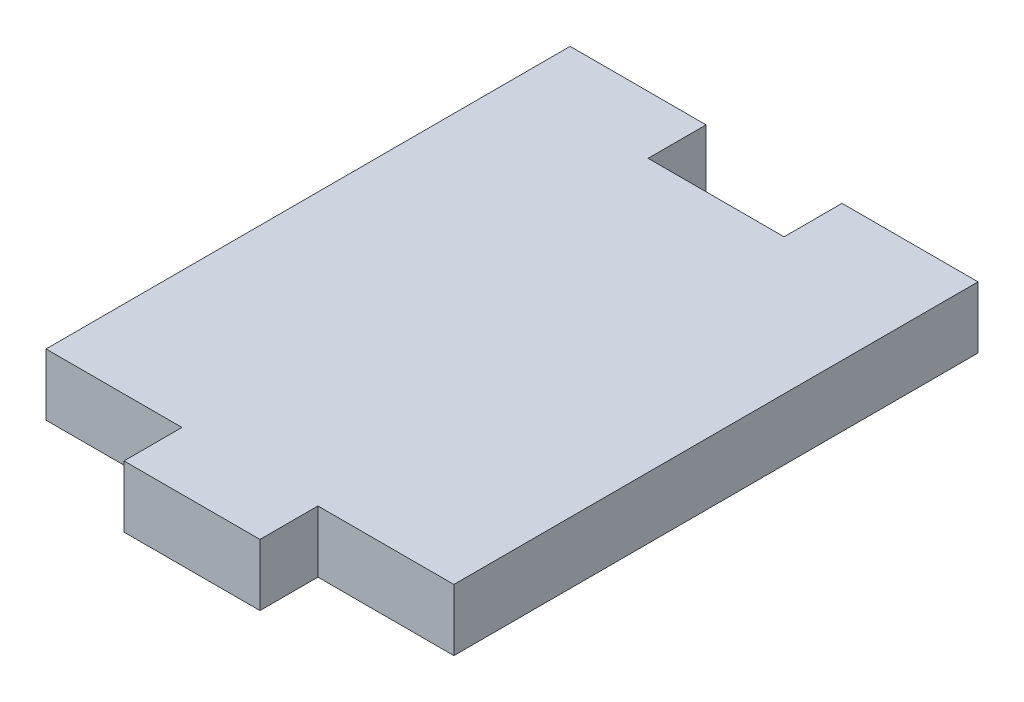
ISO-10303-21;
HEADER;
FILE_DESCRIPTION(('STEP AP214'),'2;1');
FILE_NAME('part.step','',(''),(''),'','','');
FILE_SCHEMA(('AUTOMOTIVE_DESIGN { 1 0 10303 214 1 1 1 1 }'));
ENDSEC;
DATA;
#1=APPLICATION_CONTEXT('core data for automotive mechanical design processes');
#2=APPLICATION_PROTOCOL_DEFINITION('international standard','automotive_design',2000,#1);
#3=PRODUCT_CONTEXT('',#1,'mechanical');
#4=PRODUCT('Part','Part','',(#3));
#5=PRODUCT_RELATED_PRODUCT_CATEGORY('part','',(#4));
#6=PRODUCT_DEFINITION_FORMATION('','',#4);
#7=PRODUCT_DEFINITION_CONTEXT('part definition',#1,'design');
#8=PRODUCT_DEFINITION('design','',#6,#7);
#9=PRODUCT_DEFINITION_SHAPE('','',#8);
#10=(LENGTH_UNIT() NAMED_UNIT(*) SI_UNIT(.MILLI.,.METRE.));
#11=(NAMED_UNIT(*) PLANE_ANGLE_UNIT() SI_UNIT($,.RADIAN.));
#12=(NAMED_UNIT(*) SI_UNIT($,.STERADIAN.) SOLID_ANGLE_UNIT());
#13=UNCERTAINTY_MEASURE_WITH_UNIT(LENGTH_MEASURE(1.E-05),#10,'distance_accuracy_value','');
#14=(GEOMETRIC_REPRESENTATION_CONTEXT(3) GLOBAL_UNCERTAINTY_ASSIGNED_CONTEXT((#13)) GLOBAL_UNIT_ASSIGNED_CONTEXT((#10,
#11,#12)) REPRESENTATION_CONTEXT('',''));
#15=CARTESIAN_POINT('',(0.,0.,0.));
#16=DIRECTION('',(0.,0.,1.));
#17=DIRECTION('',(1.,0.,0.));
#18=AXIS2_PLACEMENT_3D('',#15,#16,#17);
#19=CARTESIAN_POINT('',(0.,6.35,0.));
#20=DIRECTION('',(0.,0.,-1.));
#21=DIRECTION('',(-1.,0.,0.));
#22=AXIS2_PLACEMENT_3D('',#19,#20,#21);
#23=PLANE('',#22);
#24=DIRECTION('',(1.,0.,0.));
#25=VECTOR('',#24,1.);
#26=CARTESIAN_POINT('',(0.,0.,0.));
#27=LINE('',#26,#25);
#28=CARTESIAN_POINT('',(0.,0.,0.));
#29=VERTEX_POINT('',#28);
#30=CARTESIAN_POINT('',(14.,0.,0.));
#31=VERTEX_POINT('',#30);
#32=EDGE_CURVE('E156',#29,#31,#27,.T.);
#33=ORIENTED_EDGE('',*,*,#32,.T.);
#34=DIRECTION('',(0.,-1.,0.));
#35=VECTOR('',#34,1.);
#36=CARTESIAN_POINT('',(14.,6.35,0.));
#37=LINE('',#36,#35);
#38=CARTESIAN_POINT('',(14.,6.35,0.));
#39=VERTEX_POINT('',#38);
#40=EDGE_CURVE('E40',#39,#31,#37,.T.);
#41=ORIENTED_EDGE('',*,*,#40,.F.);
#42=DIRECTION('',(1.,0.,0.));
#43=VECTOR('',#42,1.);
#44=CARTESIAN_POINT('',(0.,6.35,0.));
#45=LINE('',#44,#43);
#46=CARTESIAN_POINT('',(0.,6.35,0.));
#47=VERTEX_POINT('',#46);
#48=EDGE_CURVE('E104',#47,#39,#45,.T.);
#49=ORIENTED_EDGE('',*,*,#48,.F.);
#50=DIRECTION('',(0.,-1.,0.));
#51=VECTOR('',#50,1.);
#52=CARTESIAN_POINT('',(0.,6.35,0.));
#53=LINE('',#52,#51);
#54=EDGE_CURVE('E11',#47,#29,#53,.T.);
#55=ORIENTED_EDGE('',*,*,#54,.T.);
#56=EDGE_LOOP('',(#33,#41,#49,#55));
#57=FACE_BOUND('',#56,.T.);
#58=ADVANCED_FACE('F32',(#57),#23,.F.);
#59=CARTESIAN_POINT('',(14.,6.35,0.));
#60=DIRECTION('',(1.,0.,0.));
#61=DIRECTION('',(0.,0.,-1.));
#62=AXIS2_PLACEMENT_3D('',#59,#60,#61);
#63=PLANE('',#62);
#64=DIRECTION('',(0.,0.,1.));
#65=VECTOR('',#64,1.);
#66=CARTESIAN_POINT('',(14.,0.,0.));
#67=LINE('',#66,#65);
#68=CARTESIAN_POINT('',(14.,0.,5.969));
#69=VERTEX_POINT('',#68);
#70=EDGE_CURVE('E158',#31,#69,#67,.T.);
#71=ORIENTED_EDGE('',*,*,#70,.T.);
#72=DIRECTION('',(0.,-1.,0.));
#73=VECTOR('',#72,1.);
#74=CARTESIAN_POINT('',(14.,6.35,5.969));
#75=LINE('',#74,#73);
#76=CARTESIAN_POINT('',(14.,6.35,5.969));
#77=VERTEX_POINT('',#76);
#78=EDGE_CURVE('E196',#77,#69,#75,.T.);
#79=ORIENTED_EDGE('',*,*,#78,.F.);
#80=DIRECTION('',(0.,0.,1.));
#81=VECTOR('',#80,1.);
#82=CARTESIAN_POINT('',(14.,6.35,0.));
#83=LINE('',#82,#81);
#84=EDGE_CURVE('E204',#39,#77,#83,.T.);
#85=ORIENTED_EDGE('',*,*,#84,.F.);
#86=ORIENTED_EDGE('',*,*,#40,.T.);
#87=EDGE_LOOP('',(#71,#79,#85,#86));
#88=FACE_BOUND('',#87,.T.);
#89=ADVANCED_FACE('F202',(#88),#63,.F.);
#90=CARTESIAN_POINT('',(14.,6.35,5.969));
#91=DIRECTION('',(0.,0.,-1.));
#92=DIRECTION('',(-1.,0.,0.));
#93=AXIS2_PLACEMENT_3D('',#90,#91,#92);
#94=PLANE('',#93);
#95=DIRECTION('',(1.,0.,0.));
#96=VECTOR('',#95,1.);
#97=CARTESIAN_POINT('',(14.,0.,5.969));
#98=LINE('',#97,#96);
#99=CARTESIAN_POINT('',(28.,0.,5.969));
#100=VERTEX_POINT('',#99);
#101=EDGE_CURVE('E160',#69,#100,#98,.T.);
#102=ORIENTED_EDGE('',*,*,#101,.T.);
#103=DIRECTION('',(0.,-1.,0.));
#104=VECTOR('',#103,1.);
#105=CARTESIAN_POINT('',(28.,6.35,5.969));
#106=LINE('',#105,#104);
#107=CARTESIAN_POINT('',(28.,6.35,5.969));
#108=VERTEX_POINT('',#107);
#109=EDGE_CURVE('E193',#108,#100,#106,.T.);
#110=ORIENTED_EDGE('',*,*,#109,.F.);
#111=DIRECTION('',(1.,0.,0.));
#112=VECTOR('',#111,1.);
#113=CARTESIAN_POINT('',(14.,6.35,5.969));
#114=LINE('',#113,#112);
#115=EDGE_CURVE('E223',#77,#108,#114,.T.);
#116=ORIENTED_EDGE('',*,*,#115,.F.);
#117=ORIENTED_EDGE('',*,*,#78,.T.);
#118=EDGE_LOOP('',(#102,#110,#116,#117));
#119=FACE_BOUND('',#118,.T.);
#120=ADVANCED_FACE('F214',(#119),#94,.F.);
#121=CARTESIAN_POINT('',(28.,6.35,0.));
#122=DIRECTION('',(-1.,0.,0.));
#123=DIRECTION('',(0.,0.,1.));
#124=AXIS2_PLACEMENT_3D('',#121,#122,#123);
#125=PLANE('',#124);
#126=DIRECTION('',(0.,0.,-1.));
#127=VECTOR('',#126,1.);
#128=CARTESIAN_POINT('',(28.,0.,0.));
#129=LINE('',#128,#127);
#130=CARTESIAN_POINT('',(28.,0.,0.));
#131=VERTEX_POINT('',#130);
#132=EDGE_CURVE('E162',#100,#131,#129,.T.);
#133=ORIENTED_EDGE('',*,*,#132,.T.);
#134=DIRECTION('',(0.,-1.,0.));
#135=VECTOR('',#134,1.);
#136=CARTESIAN_POINT('',(28.,6.35,0.));
#137=LINE('',#136,#135);
#138=CARTESIAN_POINT('',(28.,6.35,0.));
#139=VERTEX_POINT('',#138);
#140=EDGE_CURVE('E190',#139,#131,#137,.T.);
#141=ORIENTED_EDGE('',*,*,#140,.F.);
#142=DIRECTION('',(0.,0.,-1.));
#143=VECTOR('',#142,1.);
#144=CARTESIAN_POINT('',(28.,6.35,0.));
#145=LINE('',#144,#143);
#146=EDGE_CURVE('E220',#108,#139,#145,.T.);
#147=ORIENTED_EDGE('',*,*,#146,.F.);
#148=ORIENTED_EDGE('',*,*,#109,.T.);
#149=EDGE_LOOP('',(#133,#141,#147,#148));
#150=FACE_BOUND('',#149,.T.);
#151=ADVANCED_FACE('F218',(#150),#125,.F.);
#152=CARTESIAN_POINT('',(28.,6.35,0.));
#153=DIRECTION('',(0.,0.,-1.));
#154=DIRECTION('',(-1.,0.,0.));
#155=AXIS2_PLACEMENT_3D('',#152,#153,#154);
#156=PLANE('',#155);
#157=DIRECTION('',(1.,0.,0.));
#158=VECTOR('',#157,1.);
#159=CARTESIAN_POINT('',(28.,0.,0.));
#160=LINE('',#159,#158);
#161=CARTESIAN_POINT('',(42.,0.,0.));
#162=VERTEX_POINT('',#161);
#163=EDGE_CURVE('E164',#131,#162,#160,.T.);
#164=ORIENTED_EDGE('',*,*,#163,.T.);
#165=DIRECTION('',(0.,-1.,0.));
#166=VECTOR('',#165,1.);
#167=CARTESIAN_POINT('',(42.,6.35,0.));
#168=LINE('',#167,#166);
#169=CARTESIAN_POINT('',(42.,6.35,0.));
#170=VERTEX_POINT('',#169);
#171=EDGE_CURVE('E187',#170,#162,#168,.T.);
#172=ORIENTED_EDGE('',*,*,#171,.F.);
#173=DIRECTION('',(1.,0.,0.));
#174=VECTOR('',#173,1.);
#175=CARTESIAN_POINT('',(28.,6.35,0.));
#176=LINE('',#175,#174);
#177=EDGE_CURVE('E222',#139,#170,#176,.T.);
#178=ORIENTED_EDGE('',*,*,#177,.F.);
#179=ORIENTED_EDGE('',*,*,#140,.T.);
#180=EDGE_LOOP('',(#164,#172,#178,#179));
#181=FACE_BOUND('',#180,.T.);
#182=ADVANCED_FACE('F265',(#181),#156,.F.);
#183=CARTESIAN_POINT('',(42.,6.35,-53.969));
#184=DIRECTION('',(-1.,0.,0.));
#185=DIRECTION('',(0.,0.,1.));
#186=AXIS2_PLACEMENT_3D('',#183,#184,#185);
#187=PLANE('',#186);
#188=DIRECTION('',(0.,0.,-1.));
#189=VECTOR('',#188,1.);
#190=CARTESIAN_POINT('',(42.,0.,-53.969));
#191=LINE('',#190,#189);
#192=CARTESIAN_POINT('',(42.,0.,-53.969));
#193=VERTEX_POINT('',#192);
#194=EDGE_CURVE('E167',#162,#193,#191,.T.);
#195=ORIENTED_EDGE('',*,*,#194,.T.);
#196=DIRECTION('',(0.,-1.,0.));
#197=VECTOR('',#196,1.);
#198=CARTESIAN_POINT('',(42.,6.35,-53.969));
#199=LINE('',#198,#197);
#200=CARTESIAN_POINT('',(42.,6.35,-53.969));
#201=VERTEX_POINT('',#200);
#202=EDGE_CURVE('E184',#201,#193,#199,.T.);
#203=ORIENTED_EDGE('',*,*,#202,.F.);
#204=DIRECTION('',(0.,0.,-1.));
#205=VECTOR('',#204,1.);
#206=CARTESIAN_POINT('',(42.,6.35,0.));
#207=LINE('',#206,#205);
#208=EDGE_CURVE('E225',#170,#201,#207,.T.);
#209=ORIENTED_EDGE('',*,*,#208,.F.);
#210=ORIENTED_EDGE('',*,*,#171,.T.);
#211=EDGE_LOOP('',(#195,#203,#209,#210));
#212=FACE_BOUND('',#211,.T.);
#213=ADVANCED_FACE('F268',(#212),#187,.F.);
#214=CARTESIAN_POINT('',(28.,6.35,-53.969));
#215=DIRECTION('',(0.,0.,1.));
#216=DIRECTION('',(1.,0.,0.));
#217=AXIS2_PLACEMENT_3D('',#214,#215,#216);
#218=PLANE('',#217);
#219=DIRECTION('',(-1.,0.,0.));
#220=VECTOR('',#219,1.);
#221=CARTESIAN_POINT('',(28.,0.,-53.969));
#222=LINE('',#221,#220);
#223=CARTESIAN_POINT('',(28.,0.,-53.969));
#224=VERTEX_POINT('',#223);
#225=EDGE_CURVE('E169',#193,#224,#222,.T.);
#226=ORIENTED_EDGE('',*,*,#225,.T.);
#227=DIRECTION('',(0.,-1.,0.));
#228=VECTOR('',#227,1.);
#229=CARTESIAN_POINT('',(28.,6.35,-53.969));
#230=LINE('',#229,#228);
#231=CARTESIAN_POINT('',(28.,6.35,-53.969));
#232=VERTEX_POINT('',#231);
#233=EDGE_CURVE('E181',#232,#224,#230,.T.);
#234=ORIENTED_EDGE('',*,*,#233,.F.);
#235=DIRECTION('',(-1.,0.,0.));
#236=VECTOR('',#235,1.);
#237=CARTESIAN_POINT('',(28.,6.35,-53.969));
#238=LINE('',#237,#236);
#239=EDGE_CURVE('E231',#201,#232,#238,.T.);
#240=ORIENTED_EDGE('',*,*,#239,.F.);
#241=ORIENTED_EDGE('',*,*,#202,.T.);
#242=EDGE_LOOP('',(#226,#234,#240,#241));
#243=FACE_BOUND('',#242,.T.);
#244=ADVANCED_FACE('F237',(#243),#218,.F.);
#245=CARTESIAN_POINT('',(28.,6.35,-48.));
#246=DIRECTION('',(1.,0.,0.));
#247=DIRECTION('',(0.,0.,-1.));
#248=AXIS2_PLACEMENT_3D('',#245,#246,#247);
#249=PLANE('',#248);
#250=DIRECTION('',(0.,0.,1.));
#251=VECTOR('',#250,1.);
#252=CARTESIAN_POINT('',(28.,0.,-48.));
#253=LINE('',#252,#251);
#254=CARTESIAN_POINT('',(28.,0.,-48.));
#255=VERTEX_POINT('',#254);
#256=EDGE_CURVE('E171',#224,#255,#253,.T.);
#257=ORIENTED_EDGE('',*,*,#256,.T.);
#258=DIRECTION('',(0.,-1.,0.));
#259=VECTOR('',#258,1.);
#260=CARTESIAN_POINT('',(28.,6.35,-48.));
#261=LINE('',#260,#259);
#262=CARTESIAN_POINT('',(28.,6.35,-48.));
#263=VERTEX_POINT('',#262);
#264=EDGE_CURVE('E145',#263,#255,#261,.T.);
#265=ORIENTED_EDGE('',*,*,#264,.F.);
#266=DIRECTION('',(0.,0.,1.));
#267=VECTOR('',#266,1.);
#268=CARTESIAN_POINT('',(28.,6.35,-48.));
#269=LINE('',#268,#267);
#270=EDGE_CURVE('E136',#232,#263,#269,.T.);
#271=ORIENTED_EDGE('',*,*,#270,.F.);
#272=ORIENTED_EDGE('',*,*,#233,.T.);
#273=EDGE_LOOP('',(#257,#265,#271,#272));
#274=FACE_BOUND('',#273,.T.);
#275=ADVANCED_FACE('F241',(#274),#249,.F.);
#276=CARTESIAN_POINT('',(14.,6.35,-48.));
#277=DIRECTION('',(0.,0.,1.));
#278=DIRECTION('',(1.,0.,0.));
#279=AXIS2_PLACEMENT_3D('',#276,#277,#278);
#280=PLANE('',#279);
#281=DIRECTION('',(-1.,0.,0.));
#282=VECTOR('',#281,1.);
#283=CARTESIAN_POINT('',(14.,0.,-48.));
#284=LINE('',#283,#282);
#285=CARTESIAN_POINT('',(14.,0.,-48.));
#286=VERTEX_POINT('',#285);
#287=EDGE_CURVE('E144',#255,#286,#284,.T.);
#288=ORIENTED_EDGE('',*,*,#287,.T.);
#289=DIRECTION('',(0.,-1.,0.));
#290=VECTOR('',#289,1.);
#291=CARTESIAN_POINT('',(14.,6.35,-48.));
#292=LINE('',#291,#290);
#293=CARTESIAN_POINT('',(14.,6.35,-48.));
#294=VERTEX_POINT('',#293);
#295=EDGE_CURVE('E141',#294,#286,#292,.T.);
#296=ORIENTED_EDGE('',*,*,#295,.F.);
#297=DIRECTION('',(-1.,0.,0.));
#298=VECTOR('',#297,1.);
#299=CARTESIAN_POINT('',(14.,6.35,-48.));
#300=LINE('',#299,#298);
#301=EDGE_CURVE('E130',#263,#294,#300,.T.);
#302=ORIENTED_EDGE('',*,*,#301,.F.);
#303=ORIENTED_EDGE('',*,*,#264,.T.);
#304=EDGE_LOOP('',(#288,#296,#302,#303));
#305=FACE_BOUND('',#304,.T.);
#306=ADVANCED_FACE('F142',(#305),#280,.F.);
#307=CARTESIAN_POINT('',(14.,6.35,-48.));
#308=DIRECTION('',(-1.,0.,0.));
#309=DIRECTION('',(0.,0.,1.));
#310=AXIS2_PLACEMENT_3D('',#307,#308,#309);
#311=PLANE('',#310);
#312=DIRECTION('',(0.,0.,-1.));
#313=VECTOR('',#312,1.);
#314=CARTESIAN_POINT('',(14.,0.,-48.));
#315=LINE('',#314,#313);
#316=CARTESIAN_POINT('',(14.,0.,-53.969));
#317=VERTEX_POINT('',#316);
#318=EDGE_CURVE('E90',#286,#317,#315,.T.);
#319=ORIENTED_EDGE('',*,*,#318,.T.);
#320=DIRECTION('',(0.,-1.,0.));
#321=VECTOR('',#320,1.);
#322=CARTESIAN_POINT('',(14.,6.35,-53.969));
#323=LINE('',#322,#321);
#324=CARTESIAN_POINT('',(14.,6.35,-53.969));
#325=VERTEX_POINT('',#324);
#326=EDGE_CURVE('E146',#325,#317,#323,.T.);
#327=ORIENTED_EDGE('',*,*,#326,.F.);
#328=DIRECTION('',(0.,0.,-1.));
#329=VECTOR('',#328,1.);
#330=CARTESIAN_POINT('',(14.,6.35,-48.));
#331=LINE('',#330,#329);
#332=EDGE_CURVE('E134',#294,#325,#331,.T.);
#333=ORIENTED_EDGE('',*,*,#332,.F.);
#334=ORIENTED_EDGE('',*,*,#295,.T.);
#335=EDGE_LOOP('',(#319,#327,#333,#334));
#336=FACE_BOUND('',#335,.T.);
#337=ADVANCED_FACE('F148',(#336),#311,.F.);
#338=CARTESIAN_POINT('',(14.,6.35,-53.969));
#339=DIRECTION('',(0.,0.,1.));
#340=DIRECTION('',(1.,0.,0.));
#341=AXIS2_PLACEMENT_3D('',#338,#339,#340);
#342=PLANE('',#341);
#343=DIRECTION('',(-1.,0.,0.));
#344=VECTOR('',#343,1.);
#345=CARTESIAN_POINT('',(14.,0.,-53.969));
#346=LINE('',#345,#344);
#347=CARTESIAN_POINT('',(0.,0.,-53.969));
#348=VERTEX_POINT('',#347);
#349=EDGE_CURVE('E97',#317,#348,#346,.T.);
#350=ORIENTED_EDGE('',*,*,#349,.T.);
#351=DIRECTION('',(0.,-1.,0.));
#352=VECTOR('',#351,1.);
#353=CARTESIAN_POINT('',(0.,6.35,-53.969));
#354=LINE('',#353,#352);
#355=CARTESIAN_POINT('',(0.,6.35,-53.969));
#356=VERTEX_POINT('',#355);
#357=EDGE_CURVE('E152',#356,#348,#354,.T.);
#358=ORIENTED_EDGE('',*,*,#357,.F.);
#359=DIRECTION('',(-1.,0.,0.));
#360=VECTOR('',#359,1.);
#361=CARTESIAN_POINT('',(14.,6.35,-53.969));
#362=LINE('',#361,#360);
#363=EDGE_CURVE('E150',#325,#356,#362,.T.);
#364=ORIENTED_EDGE('',*,*,#363,.F.);
#365=ORIENTED_EDGE('',*,*,#326,.T.);
#366=EDGE_LOOP('',(#350,#358,#364,#365));
#367=FACE_BOUND('',#366,.T.);
#368=ADVANCED_FACE('F243',(#367),#342,.F.);
#369=CARTESIAN_POINT('',(0.,6.35,-53.969));
#370=DIRECTION('',(1.,0.,0.));
#371=DIRECTION('',(0.,0.,-1.));
#372=AXIS2_PLACEMENT_3D('',#369,#370,#371);
#373=PLANE('',#372);
#374=DIRECTION('',(0.,0.,1.));
#375=VECTOR('',#374,1.);
#376=CARTESIAN_POINT('',(0.,0.,-53.969));
#377=LINE('',#376,#375);
#378=EDGE_CURVE('E176',#348,#29,#377,.T.);
#379=ORIENTED_EDGE('',*,*,#378,.T.);
#380=ORIENTED_EDGE('',*,*,#54,.F.);
#381=DIRECTION('',(0.,0.,1.));
#382=VECTOR('',#381,1.);
#383=CARTESIAN_POINT('',(0.,6.35,0.));
#384=LINE('',#383,#382);
#385=EDGE_CURVE('E48',#356,#47,#384,.T.);
#386=ORIENTED_EDGE('',*,*,#385,.F.);
#387=ORIENTED_EDGE('',*,*,#357,.T.);
#388=EDGE_LOOP('',(#379,#380,#386,#387));
#389=FACE_BOUND('',#388,.T.);
#390=ADVANCED_FACE('F242',(#389),#373,.F.);
#391=CARTESIAN_POINT('',(0.,6.35,0.));
#392=DIRECTION('',(0.,1.,0.));
#393=DIRECTION('',(0.,0.,1.));
#394=AXIS2_PLACEMENT_3D('',#391,#392,#393);
#395=PLANE('',#394);
#396=ORIENTED_EDGE('',*,*,#385,.T.);
#397=ORIENTED_EDGE('',*,*,#48,.T.);
#398=ORIENTED_EDGE('',*,*,#84,.T.);
#399=ORIENTED_EDGE('',*,*,#115,.T.);
#400=ORIENTED_EDGE('',*,*,#146,.T.);
#401=ORIENTED_EDGE('',*,*,#177,.T.);
#402=ORIENTED_EDGE('',*,*,#208,.T.);
#403=ORIENTED_EDGE('',*,*,#239,.T.);
#404=ORIENTED_EDGE('',*,*,#270,.T.);
#405=ORIENTED_EDGE('',*,*,#301,.T.);
#406=ORIENTED_EDGE('',*,*,#332,.T.);
#407=ORIENTED_EDGE('',*,*,#363,.T.);
#408=EDGE_LOOP('',(#396,#397,#398,#399,#400,#401,#402,#403,#404,#405,#406,#407));
#409=FACE_BOUND('',#408,.T.);
#410=ADVANCED_FACE('F132',(#409),#395,.T.);
#411=CARTESIAN_POINT('',(0.,0.,0.));
#412=DIRECTION('',(0.,1.,0.));
#413=DIRECTION('',(0.,0.,1.));
#414=AXIS2_PLACEMENT_3D('',#411,#412,#413);
#415=PLANE('',#414);
#416=ORIENTED_EDGE('',*,*,#32,.F.);
#417=ORIENTED_EDGE('',*,*,#378,.F.);
#418=ORIENTED_EDGE('',*,*,#349,.F.);
#419=ORIENTED_EDGE('',*,*,#318,.F.);
#420=ORIENTED_EDGE('',*,*,#287,.F.);
#421=ORIENTED_EDGE('',*,*,#256,.F.);
#422=ORIENTED_EDGE('',*,*,#225,.F.);
#423=ORIENTED_EDGE('',*,*,#194,.F.);
#424=ORIENTED_EDGE('',*,*,#163,.F.);
#425=ORIENTED_EDGE('',*,*,#132,.F.);
#426=ORIENTED_EDGE('',*,*,#101,.F.);
#427=ORIENTED_EDGE('',*,*,#70,.F.);
#428=EDGE_LOOP('',(#416,#417,#418,#419,#420,#421,#422,#423,#424,#425,#426,#427));
#429=FACE_BOUND('',#428,.T.);
#430=ADVANCED_FACE('F208',(#429),#415,.F.);
#431=CLOSED_SHELL('',(#58,#89,#120,#151,#182,#213,#244,#275,#306,#337,#368,#390,#410,#430));
#432=MANIFOLD_SOLID_BREP('B2',#431);
#433=ADVANCED_BREP_SHAPE_REPRESENTATION('',(#18,#432),#14);
#434=SHAPE_DEFINITION_REPRESENTATION(#9,#433);
ENDSEC;
END-ISO-10303-21;
